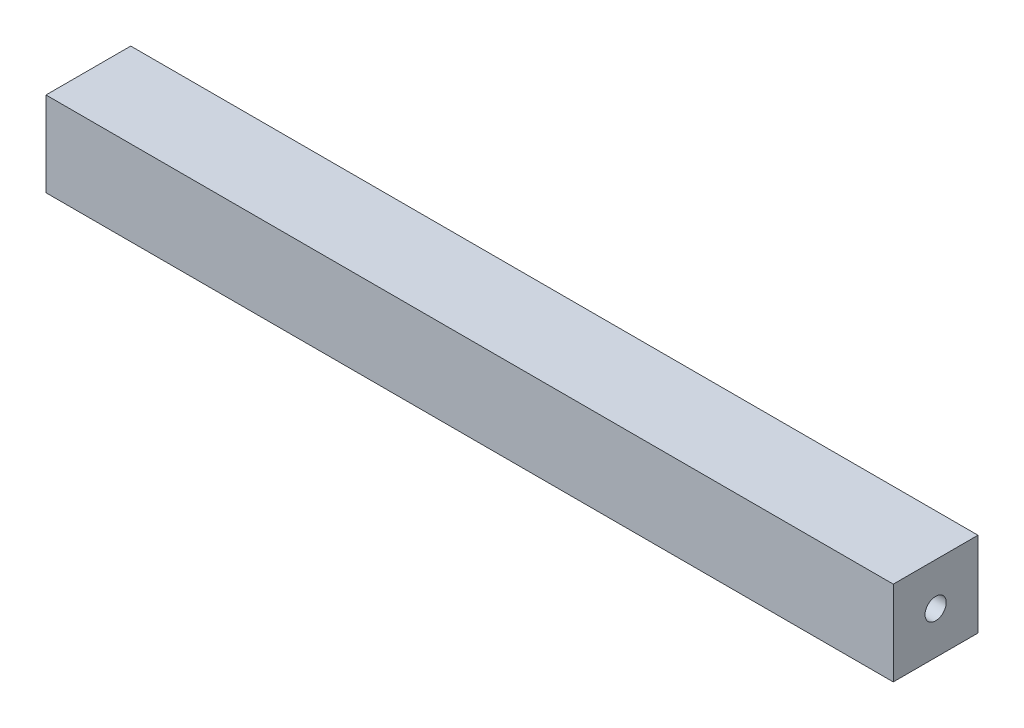
ISO-10303-21;
HEADER;
FILE_DESCRIPTION(('STEP AP214'),'2;1');
FILE_NAME('part.step','',(''),(''),'','','');
FILE_SCHEMA(('AUTOMOTIVE_DESIGN { 1 0 10303 214 1 1 1 1 }'));
ENDSEC;
DATA;
#1=APPLICATION_CONTEXT('core data for automotive mechanical design processes');
#2=APPLICATION_PROTOCOL_DEFINITION('international standard','automotive_design',2000,#1);
#3=PRODUCT_CONTEXT('',#1,'mechanical');
#4=PRODUCT('Part','Part','',(#3));
#5=PRODUCT_RELATED_PRODUCT_CATEGORY('part','',(#4));
#6=PRODUCT_DEFINITION_FORMATION('','',#4);
#7=PRODUCT_DEFINITION_CONTEXT('part definition',#1,'design');
#8=PRODUCT_DEFINITION('design','',#6,#7);
#9=PRODUCT_DEFINITION_SHAPE('','',#8);
#10=(LENGTH_UNIT() NAMED_UNIT(*) SI_UNIT(.MILLI.,.METRE.));
#11=(NAMED_UNIT(*) PLANE_ANGLE_UNIT() SI_UNIT($,.RADIAN.));
#12=(NAMED_UNIT(*) SI_UNIT($,.STERADIAN.) SOLID_ANGLE_UNIT());
#13=UNCERTAINTY_MEASURE_WITH_UNIT(LENGTH_MEASURE(1.E-05),#10,'distance_accuracy_value','');
#14=(GEOMETRIC_REPRESENTATION_CONTEXT(3) GLOBAL_UNCERTAINTY_ASSIGNED_CONTEXT((#13)) GLOBAL_UNIT_ASSIGNED_CONTEXT((#10,
#11,#12)) REPRESENTATION_CONTEXT('',''));
#15=CARTESIAN_POINT('',(0.,0.,0.));
#16=DIRECTION('',(0.,0.,1.));
#17=DIRECTION('',(1.,0.,0.));
#18=AXIS2_PLACEMENT_3D('',#15,#16,#17);
#19=CARTESIAN_POINT('',(127.,0.,0.));
#20=DIRECTION('',(-1.,0.,0.));
#21=DIRECTION('',(0.,0.,1.));
#22=AXIS2_PLACEMENT_3D('',#19,#20,#21);
#23=PLANE('',#22);
#24=DIRECTION('',(0.,-1.,0.));
#25=VECTOR('',#24,1.);
#26=CARTESIAN_POINT('',(127.,12.7,12.7));
#27=LINE('',#26,#25);
#28=CARTESIAN_POINT('',(127.,12.7,12.7));
#29=VERTEX_POINT('',#28);
#30=CARTESIAN_POINT('',(127.,-12.7,12.7));
#31=VERTEX_POINT('',#30);
#32=EDGE_CURVE('E84',#29,#31,#27,.T.);
#33=ORIENTED_EDGE('',*,*,#32,.T.);
#34=DIRECTION('',(0.,0.,-1.));
#35=VECTOR('',#34,1.);
#36=CARTESIAN_POINT('',(127.,-12.7,-12.7));
#37=LINE('',#36,#35);
#38=CARTESIAN_POINT('',(127.,-12.7,-12.7));
#39=VERTEX_POINT('',#38);
#40=EDGE_CURVE('E79',#31,#39,#37,.T.);
#41=ORIENTED_EDGE('',*,*,#40,.T.);
#42=DIRECTION('',(0.,1.,0.));
#43=VECTOR('',#42,1.);
#44=CARTESIAN_POINT('',(127.,12.7,-12.7));
#45=LINE('',#44,#43);
#46=CARTESIAN_POINT('',(127.,12.7,-12.7));
#47=VERTEX_POINT('',#46);
#48=EDGE_CURVE('E82',#39,#47,#45,.T.);
#49=ORIENTED_EDGE('',*,*,#48,.T.);
#50=DIRECTION('',(0.,0.,1.));
#51=VECTOR('',#50,1.);
#52=CARTESIAN_POINT('',(127.,12.7,-12.7));
#53=LINE('',#52,#51);
#54=EDGE_CURVE('E49',#47,#29,#53,.T.);
#55=ORIENTED_EDGE('',*,*,#54,.T.);
#56=EDGE_LOOP('',(#33,#41,#49,#55));
#57=FACE_BOUND('',#56,.T.);
#58=CARTESIAN_POINT('',(127.,0.,0.));
#59=DIRECTION('',(1.,0.,0.));
#60=DIRECTION('',(0.,0.,-1.));
#61=AXIS2_PLACEMENT_3D('',#58,#59,#60);
#62=CIRCLE('',#61,3.175);
#63=CARTESIAN_POINT('',(127.,0.,-3.175));
#64=VERTEX_POINT('',#63);
#65=EDGE_CURVE('E99',#64,#64,#62,.T.);
#66=ORIENTED_EDGE('',*,*,#65,.F.);
#67=EDGE_LOOP('',(#66));
#68=FACE_BOUND('',#67,.T.);
#69=ADVANCED_FACE('F32',(#57,#68),#23,.F.);
#70=CARTESIAN_POINT('',(-127.,0.,0.));
#71=DIRECTION('',(-1.,0.,0.));
#72=DIRECTION('',(0.,0.,1.));
#73=AXIS2_PLACEMENT_3D('',#70,#71,#72);
#74=PLANE('',#73);
#75=DIRECTION('',(0.,-1.,0.));
#76=VECTOR('',#75,1.);
#77=CARTESIAN_POINT('',(-127.,12.7,12.7));
#78=LINE('',#77,#76);
#79=CARTESIAN_POINT('',(-127.,12.7,12.7));
#80=VERTEX_POINT('',#79);
#81=CARTESIAN_POINT('',(-127.,-12.7,12.7));
#82=VERTEX_POINT('',#81);
#83=EDGE_CURVE('E96',#80,#82,#78,.T.);
#84=ORIENTED_EDGE('',*,*,#83,.F.);
#85=DIRECTION('',(0.,0.,1.));
#86=VECTOR('',#85,1.);
#87=CARTESIAN_POINT('',(-127.,12.7,-12.7));
#88=LINE('',#87,#86);
#89=CARTESIAN_POINT('',(-127.,12.7,-12.7));
#90=VERTEX_POINT('',#89);
#91=EDGE_CURVE('E72',#90,#80,#88,.T.);
#92=ORIENTED_EDGE('',*,*,#91,.F.);
#93=DIRECTION('',(0.,1.,0.));
#94=VECTOR('',#93,1.);
#95=CARTESIAN_POINT('',(-127.,12.7,-12.7));
#96=LINE('',#95,#94);
#97=CARTESIAN_POINT('',(-127.,-12.7,-12.7));
#98=VERTEX_POINT('',#97);
#99=EDGE_CURVE('E66',#98,#90,#96,.T.);
#100=ORIENTED_EDGE('',*,*,#99,.F.);
#101=DIRECTION('',(0.,0.,-1.));
#102=VECTOR('',#101,1.);
#103=CARTESIAN_POINT('',(-127.,-12.7,-12.7));
#104=LINE('',#103,#102);
#105=EDGE_CURVE('E88',#82,#98,#104,.T.);
#106=ORIENTED_EDGE('',*,*,#105,.F.);
#107=EDGE_LOOP('',(#84,#92,#100,#106));
#108=FACE_BOUND('',#107,.T.);
#109=CARTESIAN_POINT('',(-127.,0.,0.));
#110=DIRECTION('',(1.,0.,0.));
#111=DIRECTION('',(0.,0.,-1.));
#112=AXIS2_PLACEMENT_3D('',#109,#110,#111);
#113=CIRCLE('',#112,3.175);
#114=CARTESIAN_POINT('',(-127.,0.,-3.175));
#115=VERTEX_POINT('',#114);
#116=EDGE_CURVE('E111',#115,#115,#113,.T.);
#117=ORIENTED_EDGE('',*,*,#116,.T.);
#118=EDGE_LOOP('',(#117));
#119=FACE_BOUND('',#118,.T.);
#120=ADVANCED_FACE('F107',(#108,#119),#74,.T.);
#121=CARTESIAN_POINT('',(127.,12.7,12.7));
#122=DIRECTION('',(0.,0.,-1.));
#123=DIRECTION('',(0.,1.,0.));
#124=AXIS2_PLACEMENT_3D('',#121,#122,#123);
#125=PLANE('',#124);
#126=ORIENTED_EDGE('',*,*,#83,.T.);
#127=DIRECTION('',(-1.,0.,0.));
#128=VECTOR('',#127,1.);
#129=CARTESIAN_POINT('',(127.,-12.7,12.7));
#130=LINE('',#129,#128);
#131=EDGE_CURVE('E11',#31,#82,#130,.T.);
#132=ORIENTED_EDGE('',*,*,#131,.F.);
#133=ORIENTED_EDGE('',*,*,#32,.F.);
#134=DIRECTION('',(-1.,0.,0.));
#135=VECTOR('',#134,1.);
#136=CARTESIAN_POINT('',(127.,12.7,12.7));
#137=LINE('',#136,#135);
#138=EDGE_CURVE('E92',#29,#80,#137,.T.);
#139=ORIENTED_EDGE('',*,*,#138,.T.);
#140=EDGE_LOOP('',(#126,#132,#133,#139));
#141=FACE_BOUND('',#140,.T.);
#142=ADVANCED_FACE('F34',(#141),#125,.F.);
#143=CARTESIAN_POINT('',(127.,-12.7,-12.7));
#144=DIRECTION('',(0.,1.,0.));
#145=DIRECTION('',(0.,0.,1.));
#146=AXIS2_PLACEMENT_3D('',#143,#144,#145);
#147=PLANE('',#146);
#148=ORIENTED_EDGE('',*,*,#105,.T.);
#149=DIRECTION('',(-1.,0.,0.));
#150=VECTOR('',#149,1.);
#151=CARTESIAN_POINT('',(127.,-12.7,-12.7));
#152=LINE('',#151,#150);
#153=EDGE_CURVE('E41',#39,#98,#152,.T.);
#154=ORIENTED_EDGE('',*,*,#153,.F.);
#155=ORIENTED_EDGE('',*,*,#40,.F.);
#156=ORIENTED_EDGE('',*,*,#131,.T.);
#157=EDGE_LOOP('',(#148,#154,#155,#156));
#158=FACE_BOUND('',#157,.T.);
#159=ADVANCED_FACE('F87',(#158),#147,.F.);
#160=CARTESIAN_POINT('',(127.,12.7,-12.7));
#161=DIRECTION('',(0.,0.,1.));
#162=DIRECTION('',(0.,-1.,0.));
#163=AXIS2_PLACEMENT_3D('',#160,#161,#162);
#164=PLANE('',#163);
#165=ORIENTED_EDGE('',*,*,#99,.T.);
#166=DIRECTION('',(-1.,0.,0.));
#167=VECTOR('',#166,1.);
#168=CARTESIAN_POINT('',(127.,12.7,-12.7));
#169=LINE('',#168,#167);
#170=EDGE_CURVE('E89',#47,#90,#169,.T.);
#171=ORIENTED_EDGE('',*,*,#170,.F.);
#172=ORIENTED_EDGE('',*,*,#48,.F.);
#173=ORIENTED_EDGE('',*,*,#153,.T.);
#174=EDGE_LOOP('',(#165,#171,#172,#173));
#175=FACE_BOUND('',#174,.T.);
#176=ADVANCED_FACE('F90',(#175),#164,.F.);
#177=CARTESIAN_POINT('',(127.,12.7,-12.7));
#178=DIRECTION('',(0.,-1.,0.));
#179=DIRECTION('',(0.,0.,-1.));
#180=AXIS2_PLACEMENT_3D('',#177,#178,#179);
#181=PLANE('',#180);
#182=ORIENTED_EDGE('',*,*,#91,.T.);
#183=ORIENTED_EDGE('',*,*,#138,.F.);
#184=ORIENTED_EDGE('',*,*,#54,.F.);
#185=ORIENTED_EDGE('',*,*,#170,.T.);
#186=EDGE_LOOP('',(#182,#183,#184,#185));
#187=FACE_BOUND('',#186,.T.);
#188=ADVANCED_FACE('F104',(#187),#181,.F.);
#189=CARTESIAN_POINT('',(127.,0.,0.));
#190=DIRECTION('',(-1.,0.,0.));
#191=DIRECTION('',(0.,0.,1.));
#192=AXIS2_PLACEMENT_3D('',#189,#190,#191);
#193=CYLINDRICAL_SURFACE('',#192,3.175);
#194=ORIENTED_EDGE('',*,*,#65,.T.);
#195=EDGE_LOOP('',(#194));
#196=FACE_BOUND('',#195,.T.);
#197=ORIENTED_EDGE('',*,*,#116,.F.);
#198=EDGE_LOOP('',(#197));
#199=FACE_BOUND('',#198,.T.);
#200=ADVANCED_FACE('F117',(#196,#199),#193,.F.);
#201=CLOSED_SHELL('',(#69,#120,#142,#159,#176,#188,#200));
#202=MANIFOLD_SOLID_BREP('B2',#201);
#203=ADVANCED_BREP_SHAPE_REPRESENTATION('',(#18,#202),#14);
#204=SHAPE_DEFINITION_REPRESENTATION(#9,#203);
ENDSEC;
END-ISO-10303-21;
